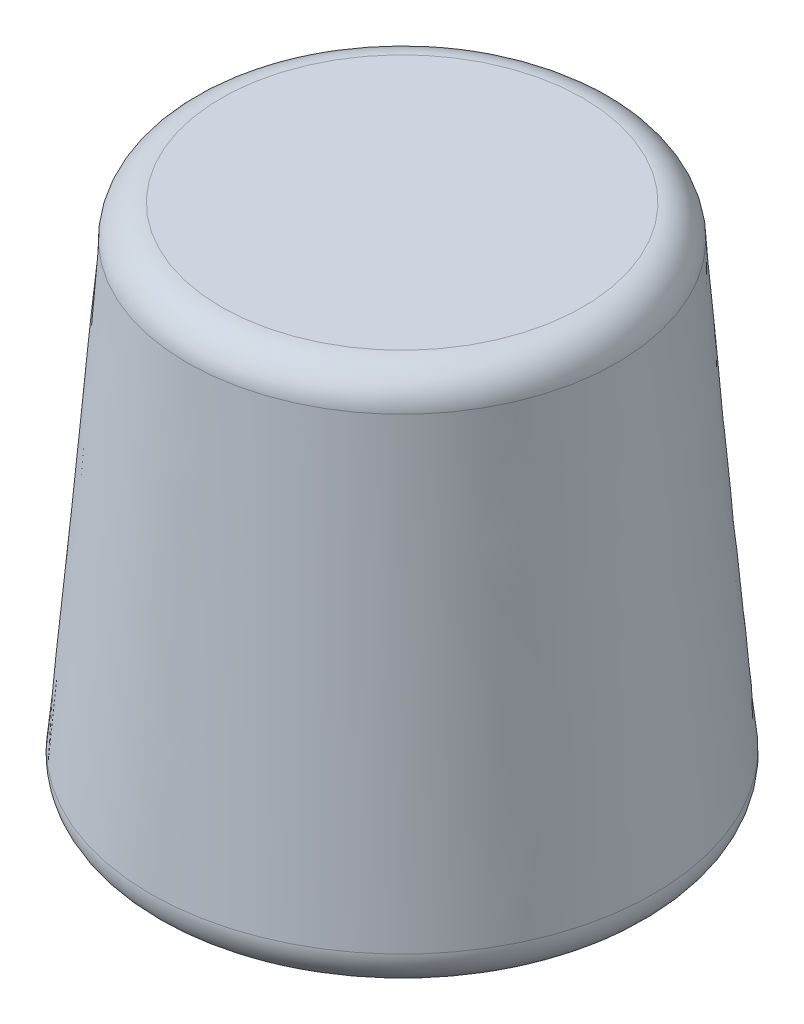
ISO-10303-21;
HEADER;
FILE_DESCRIPTION(('STEP AP214'),'2;1');
FILE_NAME('part.step','',(''),(''),'','','');
FILE_SCHEMA(('AUTOMOTIVE_DESIGN { 1 0 10303 214 1 1 1 1 }'));
ENDSEC;
DATA;
#1=APPLICATION_CONTEXT('core data for automotive mechanical design processes');
#2=APPLICATION_PROTOCOL_DEFINITION('international standard','automotive_design',2000,#1);
#3=PRODUCT_CONTEXT('',#1,'mechanical');
#4=PRODUCT('Part','Part','',(#3));
#5=PRODUCT_RELATED_PRODUCT_CATEGORY('part','',(#4));
#6=PRODUCT_DEFINITION_FORMATION('','',#4);
#7=PRODUCT_DEFINITION_CONTEXT('part definition',#1,'design');
#8=PRODUCT_DEFINITION('design','',#6,#7);
#9=PRODUCT_DEFINITION_SHAPE('','',#8);
#10=(LENGTH_UNIT() NAMED_UNIT(*) SI_UNIT(.MILLI.,.METRE.));
#11=(NAMED_UNIT(*) PLANE_ANGLE_UNIT() SI_UNIT($,.RADIAN.));
#12=(NAMED_UNIT(*) SI_UNIT($,.STERADIAN.) SOLID_ANGLE_UNIT());
#13=UNCERTAINTY_MEASURE_WITH_UNIT(LENGTH_MEASURE(1.E-05),#10,'distance_accuracy_value','');
#14=(GEOMETRIC_REPRESENTATION_CONTEXT(3) GLOBAL_UNCERTAINTY_ASSIGNED_CONTEXT((#13)) GLOBAL_UNIT_ASSIGNED_CONTEXT((#10,
#11,#12)) REPRESENTATION_CONTEXT('',''));
#15=CARTESIAN_POINT('',(0.,0.,0.));
#16=DIRECTION('',(0.,0.,1.));
#17=DIRECTION('',(1.,0.,0.));
#18=AXIS2_PLACEMENT_3D('',#15,#16,#17);
#19=CARTESIAN_POINT('',(0.,38.1,0.));
#20=DIRECTION('',(0.,1.,0.));
#21=DIRECTION('',(0.,0.,1.));
#22=AXIS2_PLACEMENT_3D('',#19,#20,#21);
#23=PLANE('',#22);
#24=CARTESIAN_POINT('',(0.,38.1,0.));
#25=DIRECTION('',(0.,1.,0.));
#26=DIRECTION('',(0.,0.,1.));
#27=AXIS2_PLACEMENT_3D('',#24,#25,#26);
#28=CIRCLE('',#27,13.5137494794909);
#29=CARTESIAN_POINT('',(0.,38.1,13.5137494794909));
#30=VERTEX_POINT('',#29);
#31=EDGE_CURVE('E11',#30,#30,#28,.T.);
#32=ORIENTED_EDGE('',*,*,#31,.T.);
#33=EDGE_LOOP('',(#32));
#34=FACE_BOUND('',#33,.T.);
#35=ADVANCED_FACE('F37',(#34),#23,.T.);
#36=CARTESIAN_POINT('',(0.,0.,0.));
#37=DIRECTION('',(0.,1.,0.));
#38=DIRECTION('',(0.,0.,1.));
#39=AXIS2_PLACEMENT_3D('',#36,#37,#38);
#40=PLANE('',#39);
#41=CARTESIAN_POINT('',(0.,0.,0.));
#42=DIRECTION('',(0.,1.,0.));
#43=DIRECTION('',(0.,0.,1.));
#44=AXIS2_PLACEMENT_3D('',#41,#42,#43);
#45=CIRCLE('',#44,16.2655323467673);
#46=CARTESIAN_POINT('',(0.,0.,16.2655323467673));
#47=VERTEX_POINT('',#46);
#48=EDGE_CURVE('E44',#47,#47,#45,.F.);
#49=ORIENTED_EDGE('',*,*,#48,.T.);
#50=EDGE_LOOP('',(#49));
#51=FACE_BOUND('',#50,.T.);
#52=ADVANCED_FACE('F68',(#51),#40,.F.);
#53=CARTESIAN_POINT('',(16.4093085744436,0.,9.67662607052119));
#54=CARTESIAN_POINT('',(11.6810392078393,38.1,10.7502999039525));
#55=CARTESIAN_POINT('',(35.762560715486,0.,-23.1419910783661));
#56=CARTESIAN_POINT('',(33.1816390157443,38.1,-12.611778511726));
#57=CARTESIAN_POINT('',(2.94394356659875,0.,-42.4952432194085));
#58=CARTESIAN_POINT('',(9.81956060006581,38.1,-34.1123783196311));
#59=CARTESIAN_POINT('',(-16.4093085744436,0.,-9.6766260705212));
#60=CARTESIAN_POINT('',(-11.6810392078393,38.1,-10.7502999039525));
#61=CARTESIAN_POINT('',(-35.762560715486,0.,23.1419910783661));
#62=CARTESIAN_POINT('',(-33.1816390157444,38.1,12.611778511726));
#63=CARTESIAN_POINT('',(-2.94394356659876,0.,42.4952432194085));
#64=CARTESIAN_POINT('',(-9.81956060006581,38.1,34.1123783196311));
#65=CARTESIAN_POINT('',(16.4093085744436,0.,9.67662607052119));
#66=CARTESIAN_POINT('',(11.6810392078393,38.1,10.7502999039525));
#67=(BOUNDED_SURFACE() B_SPLINE_SURFACE(3,1,((#53,#54),(#55,#56),(#57,#58),(#59,#60),(#61,#62),
(#63,#64),(#65,#66)),.UNSPECIFIED.,.T.,.F.,.F.) B_SPLINE_SURFACE_WITH_KNOTS((4,3,4),(2,2),(0.,
0.5,1.),(0.,1.),.UNSPECIFIED.) GEOMETRIC_REPRESENTATION_ITEM() RATIONAL_B_SPLINE_SURFACE(((1.,
1.),(0.333333333333334,0.333333333333333),(0.333333333333334,0.333333333333333),(1.,1.),
(0.333333333333333,0.333333333333333),(0.333333333333333,0.333333333333333),(1.,1.))) REPRESENTATION_ITEM('') SURFACE());
#68=CARTESIAN_POINT('',(0.,2.77132392335498,0.));
#69=DIRECTION('',(0.,1.,0.));
#70=DIRECTION('',(0.,0.,1.));
#71=AXIS2_PLACEMENT_3D('',#68,#69,#70);
#72=CIRCLE('',#71,18.7949768000976);
#73=CARTESIAN_POINT('',(16.0653829573377,2.77132392335498,9.75472313037601));
#74=VERTEX_POINT('',#73);
#75=EDGE_CURVE('E48',#74,#74,#72,.T.);
#76=CARTESIAN_POINT('',(0.,35.7470278433327,0.));
#77=DIRECTION('',(0.,1.,0.));
#78=DIRECTION('',(0.,0.,1.));
#79=AXIS2_PLACEMENT_3D('',#76,#77,#78);
#80=CIRCLE('',#79,16.046854409378);
#81=CARTESIAN_POINT('',(11.9730467188325,35.7470278433327,10.6839921707398));
#82=VERTEX_POINT('',#81);
#83=EDGE_CURVE('E52',#82,#82,#80,.F.);
#84=CARTESIAN_POINT('',(16.0653829573377,2.77132392335498,9.75472313037601));
#85=CARTESIAN_POINT('',(16.0227544548533,3.11482083918808,9.76440301621313));
#86=CARTESIAN_POINT('',(15.9801259523688,3.45831775502118,9.77408290205025));
#87=CARTESIAN_POINT('',(15.8948689474,4.14531158668738,9.7934426737245));
#88=CARTESIAN_POINT('',(15.8522404449155,4.48880850252048,9.80312255956162));
#89=CARTESIAN_POINT('',(15.7669834399467,5.17580233418669,9.82248233123587));
#90=CARTESIAN_POINT('',(15.7243549374622,5.51929925001979,9.83216221707299));
#91=CARTESIAN_POINT('',(15.6390979324934,6.20629308168599,9.85152198874724));
#92=CARTESIAN_POINT('',(15.596469430009,6.54978999751909,9.86120187458436));
#93=CARTESIAN_POINT('',(15.5112124250401,7.2367838291853,9.8805616462586));
#94=CARTESIAN_POINT('',(15.4685839225557,7.5802807450184,9.89024153209572));
#95=CARTESIAN_POINT('',(15.3833269175868,8.2672745766846,9.90960130376997));
#96=CARTESIAN_POINT('',(15.3406984151024,8.6107714925177,9.91928118960709));
#97=CARTESIAN_POINT('',(15.2554414101335,9.2977653241839,9.93864096128134));
#98=CARTESIAN_POINT('',(15.2128129076491,9.64126224001701,9.94832084711846));
#99=CARTESIAN_POINT('',(15.1275559026802,10.3282560716832,9.96768061879271));
#100=CARTESIAN_POINT('',(15.0849274001958,10.6717529875163,9.97736050462983));
#101=CARTESIAN_POINT('',(14.999670395227,11.3587468191825,9.99672027630407));
#102=CARTESIAN_POINT('',(14.9570418927425,11.7022437350156,10.0064001621412));
#103=CARTESIAN_POINT('',(14.8717848877737,12.3892375666818,10.0257599338154));
#104=CARTESIAN_POINT('',(14.8291563852892,12.7327344825149,10.0354398196526));
#105=CARTESIAN_POINT('',(14.7438993803204,13.4197283141811,10.0547995913268));
#106=CARTESIAN_POINT('',(14.701270877836,13.7632252300142,10.0644794771639));
#107=CARTESIAN_POINT('',(14.6160138728671,14.4502190616804,10.0838392488382));
#108=CARTESIAN_POINT('',(14.5733853703827,14.7937159775135,10.0935191346753));
#109=CARTESIAN_POINT('',(14.4881283654138,15.4807098091797,10.1128789063495));
#110=CARTESIAN_POINT('',(14.4454998629294,15.8242067250128,10.1225587921867));
#111=CARTESIAN_POINT('',(14.3602428579605,16.511200556679,10.1419185638609));
#112=CARTESIAN_POINT('',(14.3176143554761,16.8546974725121,10.151598449698));
#113=CARTESIAN_POINT('',(14.2323573505072,17.5416913041783,10.1709582213723));
#114=CARTESIAN_POINT('',(14.1897288480228,17.8851882200114,10.1806381072094));
#115=CARTESIAN_POINT('',(14.104471843054,18.5721820516776,10.1999978788836));
#116=CARTESIAN_POINT('',(14.0618433405695,18.9156789675107,10.2096777647208));
#117=CARTESIAN_POINT('',(13.9765863356007,19.602672799177,10.229037536395));
#118=CARTESIAN_POINT('',(13.9339578331162,19.9461697150101,10.2387174222321));
#119=CARTESIAN_POINT('',(13.8487008281474,20.6331635466763,10.2580771939064));
#120=CARTESIAN_POINT('',(13.806072325663,20.9766604625094,10.2677570797435));
#121=CARTESIAN_POINT('',(13.7208153206941,21.6636542941756,10.2871168514177));
#122=CARTESIAN_POINT('',(13.6781868182097,22.0071512100087,10.2967967372549));
#123=CARTESIAN_POINT('',(13.5929298132408,22.6941450416749,10.3161565089291));
#124=CARTESIAN_POINT('',(13.5503013107564,23.037641957508,10.3258363947662));
#125=CARTESIAN_POINT('',(13.4650443057875,23.7246357891742,10.3451961664405));
#126=CARTESIAN_POINT('',(13.4224158033031,24.0681327050073,10.3548760522776));
#127=CARTESIAN_POINT('',(13.3371587983342,24.7551265366735,10.3742358239519));
#128=CARTESIAN_POINT('',(13.2945302958498,25.0986234525066,10.383915709789));
#129=CARTESIAN_POINT('',(13.209273290881,25.7856172841728,10.4032754814632));
#130=CARTESIAN_POINT('',(13.1666447883965,26.1291142000059,10.4129553673003));
#131=CARTESIAN_POINT('',(13.0813877834277,26.8161080316721,10.4323151389746));
#132=CARTESIAN_POINT('',(13.0387592809432,27.1596049475052,10.4419950248117));
#133=CARTESIAN_POINT('',(12.9535022759744,27.8465987791714,10.461354796486));
#134=CARTESIAN_POINT('',(12.9108737734899,28.1900956950045,10.4710346823231));
#135=CARTESIAN_POINT('',(12.8256167685211,28.8770895266707,10.4903944539973));
#136=CARTESIAN_POINT('',(12.7829882660367,29.2205864425038,10.5000743398344));
#137=CARTESIAN_POINT('',(12.6977312610678,29.90758027417,10.5194341115087));
#138=CARTESIAN_POINT('',(12.6551027585834,30.2510771900031,10.5291139973458));
#139=CARTESIAN_POINT('',(12.5698457536145,30.9380710216693,10.5484737690201));
#140=CARTESIAN_POINT('',(12.5272172511301,31.2815679375024,10.5581536548572));
#141=CARTESIAN_POINT('',(12.4419602461612,31.9685617691686,10.5775134265314));
#142=CARTESIAN_POINT('',(12.3993317436768,32.3120586850017,10.5871933123686));
#143=CARTESIAN_POINT('',(12.3140747387079,32.9990525166679,10.6065530840428));
#144=CARTESIAN_POINT('',(12.2714462362235,33.342549432501,10.6162329698799));
#145=CARTESIAN_POINT('',(12.1861892312547,34.0295432641672,10.6355927415542));
#146=CARTESIAN_POINT('',(12.1435607287702,34.3730401800003,10.6452726273913));
#147=CARTESIAN_POINT('',(12.0583037238014,35.0600340116665,10.6646323990655));
#148=CARTESIAN_POINT('',(12.0156752213169,35.4035309274996,10.6743122849027));
#149=CARTESIAN_POINT('',(11.9730467188325,35.7470278433327,10.6839921707398));
#150=B_SPLINE_CURVE_WITH_KNOTS('',3,(#84,#85,#86,#87,#88,#89,#90,#91,#92,#93,#94,#95,#96,#97,
#98,#99,#100,#101,#102,#103,#104,#105,#106,#107,#108,#109,#110,#111,#112,#113,#114,#115,#116,
#117,#118,#119,#120,#121,#122,#123,#124,#125,#126,#127,#128,#129,#130,#131,#132,#133,#134,#135,
#136,#137,#138,#139,#140,#141,#142,#143,#144,#145,#146,#147,#148,#149),.UNSPECIFIED.,.F.,.F.,(4,
2,2,2,2,2,2,2,2,2,2,2,2,2,2,2,2,2,2,2,2,2,2,2,2,2,2,2,2,2,2,2,4),(0.,1.03880180275481,
2.07760360550962,3.11640540826442,4.15520721101923,5.19400901377404,6.23281081652885,
7.27161261928365,8.31041442203846,9.34921622479327,10.3880180275481,11.4268198303029,
12.4656216330577,13.5044234358125,14.5432252385673,15.5820270413221,16.6208288440769,
17.6596306468317,18.6984324495865,19.7372342523413,20.7760360550961,21.814837857851,
22.8536396606058,23.8924414633606,24.9312432661154,25.9700450688702,27.008846871625,
28.0476486743798,29.0864504771346,30.1252522798894,31.1640540826442,32.202855885399,
33.2416576881538),.UNSPECIFIED.);
#151=EDGE_CURVE('BSEAM58',#74,#82,#150,.T.);
#152=ORIENTED_EDGE('',*,*,#75,.T.);
#153=ORIENTED_EDGE('',*,*,#83,.T.);
#154=ORIENTED_EDGE('',*,*,#151,.T.);
#155=ORIENTED_EDGE('',*,*,#151,.F.);
#156=EDGE_LOOP('',(#152,#154,#153,#155));
#157=FACE_BOUND('',#156,.T.);
#158=ADVANCED_FACE('F58',(#157),#67,.T.);
#159=CARTESIAN_POINT('',(0.,2.54,0.));
#160=DIRECTION('',(0.,1.,0.));
#161=DIRECTION('',(0.,0.,1.));
#162=AXIS2_PLACEMENT_3D('',#159,#160,#161);
#163=TOROIDAL_SURFACE('',#162,16.2655323467673,2.54);
#164=ORIENTED_EDGE('',*,*,#48,.F.);
#165=EDGE_LOOP('',(#164));
#166=FACE_BOUND('',#165,.T.);
#167=ORIENTED_EDGE('',*,*,#75,.F.);
#168=EDGE_LOOP('',(#167));
#169=FACE_BOUND('',#168,.T.);
#170=ADVANCED_FACE('F62',(#166,#169),#163,.T.);
#171=CARTESIAN_POINT('',(0.,35.56,0.));
#172=DIRECTION('',(0.,1.,0.));
#173=DIRECTION('',(0.,0.,1.));
#174=AXIS2_PLACEMENT_3D('',#171,#172,#173);
#175=TOROIDAL_SURFACE('',#174,13.5137494794909,2.54);
#176=ORIENTED_EDGE('',*,*,#83,.F.);
#177=EDGE_LOOP('',(#176));
#178=FACE_BOUND('',#177,.T.);
#179=ORIENTED_EDGE('',*,*,#31,.F.);
#180=EDGE_LOOP('',(#179));
#181=FACE_BOUND('',#180,.T.);
#182=ADVANCED_FACE('F39',(#178,#181),#175,.T.);
#183=CLOSED_SHELL('',(#35,#52,#158,#170,#182));
#184=MANIFOLD_SOLID_BREP('B2',#183);
#185=ADVANCED_BREP_SHAPE_REPRESENTATION('',(#18,#184),#14);
#186=SHAPE_DEFINITION_REPRESENTATION(#9,#185);
ENDSEC;
END-ISO-10303-21;
